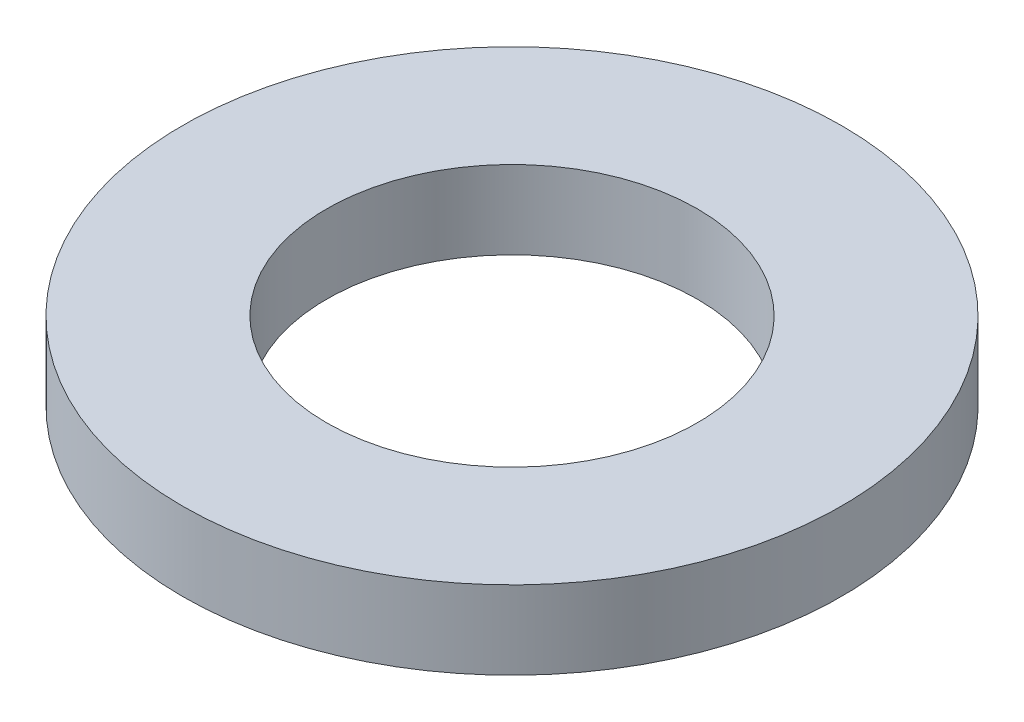
ISO-10303-21;
HEADER;
FILE_DESCRIPTION(('STEP AP214'),'2;1');
FILE_NAME('part.step','',(''),(''),'','','');
FILE_SCHEMA(('AUTOMOTIVE_DESIGN { 1 0 10303 214 1 1 1 1 }'));
ENDSEC;
DATA;
#1=APPLICATION_CONTEXT('core data for automotive mechanical design processes');
#2=APPLICATION_PROTOCOL_DEFINITION('international standard','automotive_design',2000,#1);
#3=PRODUCT_CONTEXT('',#1,'mechanical');
#4=PRODUCT('Part','Part','',(#3));
#5=PRODUCT_RELATED_PRODUCT_CATEGORY('part','',(#4));
#6=PRODUCT_DEFINITION_FORMATION('','',#4);
#7=PRODUCT_DEFINITION_CONTEXT('part definition',#1,'design');
#8=PRODUCT_DEFINITION('design','',#6,#7);
#9=PRODUCT_DEFINITION_SHAPE('','',#8);
#10=(LENGTH_UNIT() NAMED_UNIT(*) SI_UNIT(.MILLI.,.METRE.));
#11=(NAMED_UNIT(*) PLANE_ANGLE_UNIT() SI_UNIT($,.RADIAN.));
#12=(NAMED_UNIT(*) SI_UNIT($,.STERADIAN.) SOLID_ANGLE_UNIT());
#13=UNCERTAINTY_MEASURE_WITH_UNIT(LENGTH_MEASURE(1.E-05),#10,'distance_accuracy_value','');
#14=(GEOMETRIC_REPRESENTATION_CONTEXT(3) GLOBAL_UNCERTAINTY_ASSIGNED_CONTEXT((#13)) GLOBAL_UNIT_ASSIGNED_CONTEXT((#10,
#11,#12)) REPRESENTATION_CONTEXT('',''));
#15=CARTESIAN_POINT('',(0.,0.,0.));
#16=DIRECTION('',(0.,0.,1.));
#17=DIRECTION('',(1.,0.,0.));
#18=AXIS2_PLACEMENT_3D('',#15,#16,#17);
#19=CARTESIAN_POINT('',(0.,19.,0.));
#20=DIRECTION('',(0.,-1.,0.));
#21=DIRECTION('',(0.,0.,-1.));
#22=AXIS2_PLACEMENT_3D('',#19,#20,#21);
#23=CYLINDRICAL_SURFACE('',#22,80.);
#24=CARTESIAN_POINT('',(0.,19.,0.));
#25=DIRECTION('',(0.,1.,0.));
#26=DIRECTION('',(0.,0.,1.));
#27=AXIS2_PLACEMENT_3D('',#24,#25,#26);
#28=CIRCLE('',#27,80.);
#29=CARTESIAN_POINT('',(0.,19.,80.));
#30=VERTEX_POINT('',#29);
#31=EDGE_CURVE('E10',#30,#30,#28,.T.);
#32=ORIENTED_EDGE('',*,*,#31,.F.);
#33=EDGE_LOOP('',(#32));
#34=FACE_BOUND('',#33,.T.);
#35=CARTESIAN_POINT('',(0.,0.,0.));
#36=DIRECTION('',(0.,1.,0.));
#37=DIRECTION('',(0.,0.,1.));
#38=AXIS2_PLACEMENT_3D('',#35,#36,#37);
#39=CIRCLE('',#38,80.);
#40=CARTESIAN_POINT('',(0.,0.,80.));
#41=VERTEX_POINT('',#40);
#42=EDGE_CURVE('E37',#41,#41,#39,.T.);
#43=ORIENTED_EDGE('',*,*,#42,.T.);
#44=EDGE_LOOP('',(#43));
#45=FACE_BOUND('',#44,.T.);
#46=ADVANCED_FACE('F40',(#34,#45),#23,.T.);
#47=CARTESIAN_POINT('',(0.,19.,0.));
#48=DIRECTION('',(0.,1.,0.));
#49=DIRECTION('',(0.,0.,1.));
#50=AXIS2_PLACEMENT_3D('',#47,#48,#49);
#51=PLANE('',#50);
#52=CARTESIAN_POINT('',(0.,19.,0.));
#53=DIRECTION('',(0.,1.,0.));
#54=DIRECTION('',(0.,0.,1.));
#55=AXIS2_PLACEMENT_3D('',#52,#53,#54);
#56=CIRCLE('',#55,45.);
#57=CARTESIAN_POINT('',(0.,19.,45.));
#58=VERTEX_POINT('',#57);
#59=EDGE_CURVE('E50',#58,#58,#56,.T.);
#60=ORIENTED_EDGE('',*,*,#59,.F.);
#61=EDGE_LOOP('',(#60));
#62=FACE_BOUND('',#61,.T.);
#63=ORIENTED_EDGE('',*,*,#31,.T.);
#64=EDGE_LOOP('',(#63));
#65=FACE_BOUND('',#64,.T.);
#66=ADVANCED_FACE('F59',(#62,#65),#51,.T.);
#67=CARTESIAN_POINT('',(0.,0.,0.));
#68=DIRECTION('',(0.,1.,0.));
#69=DIRECTION('',(0.,0.,1.));
#70=AXIS2_PLACEMENT_3D('',#67,#68,#69);
#71=PLANE('',#70);
#72=CARTESIAN_POINT('',(0.,0.,0.));
#73=DIRECTION('',(0.,1.,0.));
#74=DIRECTION('',(0.,0.,1.));
#75=AXIS2_PLACEMENT_3D('',#72,#73,#74);
#76=CIRCLE('',#75,45.);
#77=CARTESIAN_POINT('',(0.,0.,45.));
#78=VERTEX_POINT('',#77);
#79=EDGE_CURVE('E47',#78,#78,#76,.T.);
#80=ORIENTED_EDGE('',*,*,#79,.T.);
#81=EDGE_LOOP('',(#80));
#82=FACE_BOUND('',#81,.T.);
#83=ORIENTED_EDGE('',*,*,#42,.F.);
#84=EDGE_LOOP('',(#83));
#85=FACE_BOUND('',#84,.T.);
#86=ADVANCED_FACE('F58',(#82,#85),#71,.F.);
#87=CARTESIAN_POINT('',(0.,19.,0.));
#88=DIRECTION('',(0.,-1.,0.));
#89=DIRECTION('',(0.,0.,-1.));
#90=AXIS2_PLACEMENT_3D('',#87,#88,#89);
#91=CYLINDRICAL_SURFACE('',#90,45.);
#92=ORIENTED_EDGE('',*,*,#59,.T.);
#93=EDGE_LOOP('',(#92));
#94=FACE_BOUND('',#93,.T.);
#95=ORIENTED_EDGE('',*,*,#79,.F.);
#96=EDGE_LOOP('',(#95));
#97=FACE_BOUND('',#96,.T.);
#98=ADVANCED_FACE('F54',(#94,#97),#91,.F.);
#99=CLOSED_SHELL('',(#46,#66,#86,#98));
#100=MANIFOLD_SOLID_BREP('B2',#99);
#101=ADVANCED_BREP_SHAPE_REPRESENTATION('',(#18,#100),#14);
#102=SHAPE_DEFINITION_REPRESENTATION(#9,#101);
ENDSEC;
END-ISO-10303-21;
